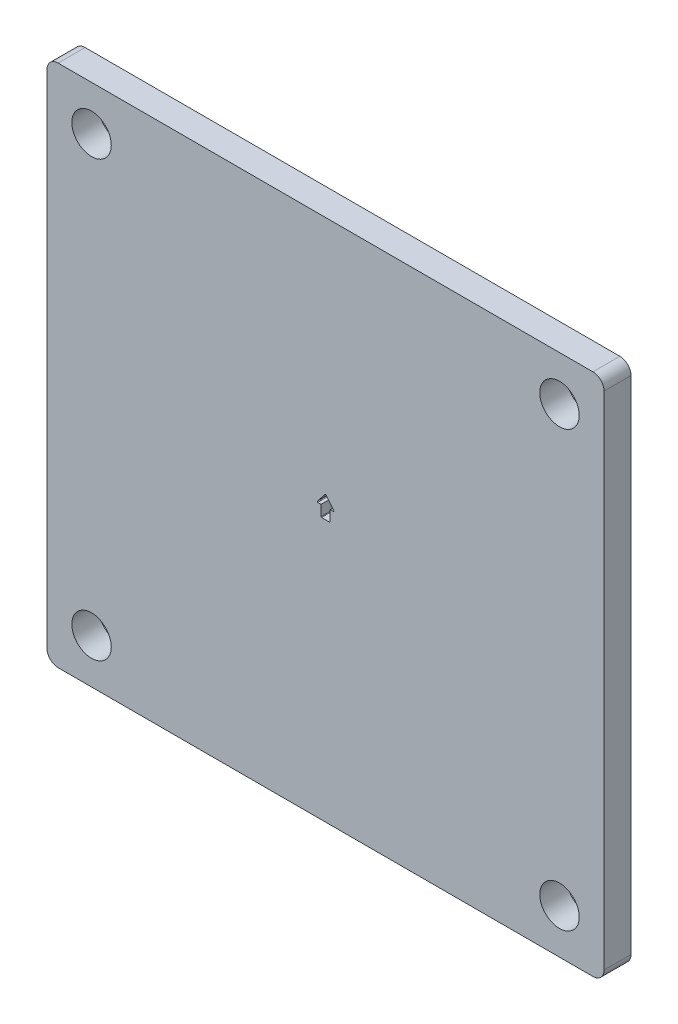
ISO-10303-21;
HEADER;
FILE_DESCRIPTION(('STEP AP214'),'2;1');
FILE_NAME('part.step','',(''),(''),'','','');
FILE_SCHEMA(('AUTOMOTIVE_DESIGN { 1 0 10303 214 1 1 1 1 }'));
ENDSEC;
DATA;
#1=APPLICATION_CONTEXT('core data for automotive mechanical design processes');
#2=APPLICATION_PROTOCOL_DEFINITION('international standard','automotive_design',2000,#1);
#3=PRODUCT_CONTEXT('',#1,'mechanical');
#4=PRODUCT('Part','Part','',(#3));
#5=PRODUCT_RELATED_PRODUCT_CATEGORY('part','',(#4));
#6=PRODUCT_DEFINITION_FORMATION('','',#4);
#7=PRODUCT_DEFINITION_CONTEXT('part definition',#1,'design');
#8=PRODUCT_DEFINITION('design','',#6,#7);
#9=PRODUCT_DEFINITION_SHAPE('','',#8);
#10=(LENGTH_UNIT() NAMED_UNIT(*) SI_UNIT(.MILLI.,.METRE.));
#11=(NAMED_UNIT(*) PLANE_ANGLE_UNIT() SI_UNIT($,.RADIAN.));
#12=(NAMED_UNIT(*) SI_UNIT($,.STERADIAN.) SOLID_ANGLE_UNIT());
#13=UNCERTAINTY_MEASURE_WITH_UNIT(LENGTH_MEASURE(1.E-05),#10,'distance_accuracy_value','');
#14=(GEOMETRIC_REPRESENTATION_CONTEXT(3) GLOBAL_UNCERTAINTY_ASSIGNED_CONTEXT((#13)) GLOBAL_UNIT_ASSIGNED_CONTEXT((#10,
#11,#12)) REPRESENTATION_CONTEXT('',''));
#15=CARTESIAN_POINT('',(0.,0.,0.));
#16=DIRECTION('',(0.,0.,1.));
#17=DIRECTION('',(1.,0.,0.));
#18=AXIS2_PLACEMENT_3D('',#15,#16,#17);
#19=CARTESIAN_POINT('',(0.,0.,3.0734));
#20=DIRECTION('',(1.,0.,0.));
#21=DIRECTION('',(0.,0.,-1.));
#22=AXIS2_PLACEMENT_3D('',#19,#20,#21);
#23=PLANE('',#22);
#24=DIRECTION('',(0.,-1.,0.));
#25=VECTOR('',#24,1.);
#26=CARTESIAN_POINT('',(0.,0.,0.));
#27=LINE('',#26,#25);
#28=CARTESIAN_POINT('',(0.,58.42,0.));
#29=VERTEX_POINT('',#28);
#30=CARTESIAN_POINT('',(0.,1.27,0.));
#31=VERTEX_POINT('',#30);
#32=EDGE_CURVE('E242',#29,#31,#27,.T.);
#33=ORIENTED_EDGE('',*,*,#32,.T.);
#34=DIRECTION('',(0.,0.,-1.));
#35=VECTOR('',#34,1.);
#36=CARTESIAN_POINT('',(0.,1.27,3.0734));
#37=LINE('',#36,#35);
#38=CARTESIAN_POINT('',(0.,1.27,3.0734));
#39=VERTEX_POINT('',#38);
#40=EDGE_CURVE('E282',#31,#39,#37,.F.);
#41=ORIENTED_EDGE('',*,*,#40,.T.);
#42=DIRECTION('',(0.,-1.,0.));
#43=VECTOR('',#42,1.);
#44=CARTESIAN_POINT('',(0.,0.,3.0734));
#45=LINE('',#44,#43);
#46=CARTESIAN_POINT('',(0.,58.42,3.0734));
#47=VERTEX_POINT('',#46);
#48=EDGE_CURVE('E243',#47,#39,#45,.T.);
#49=ORIENTED_EDGE('',*,*,#48,.F.);
#50=DIRECTION('',(0.,0.,-1.));
#51=VECTOR('',#50,1.);
#52=CARTESIAN_POINT('',(0.,58.42,3.0734));
#53=LINE('',#52,#51);
#54=EDGE_CURVE('E279',#47,#29,#53,.T.);
#55=ORIENTED_EDGE('',*,*,#54,.T.);
#56=EDGE_LOOP('',(#33,#41,#49,#55));
#57=FACE_BOUND('',#56,.T.);
#58=ADVANCED_FACE('F32',(#57),#23,.F.);
#59=CARTESIAN_POINT('',(0.,0.,3.0734));
#60=DIRECTION('',(0.,1.,0.));
#61=DIRECTION('',(0.,0.,1.));
#62=AXIS2_PLACEMENT_3D('',#59,#60,#61);
#63=PLANE('',#62);
#64=DIRECTION('',(1.,0.,0.));
#65=VECTOR('',#64,1.);
#66=CARTESIAN_POINT('',(0.,0.,3.0734));
#67=LINE('',#66,#65);
#68=CARTESIAN_POINT('',(1.27,0.,3.0734));
#69=VERTEX_POINT('',#68);
#70=CARTESIAN_POINT('',(62.23,0.,3.0734));
#71=VERTEX_POINT('',#70);
#72=EDGE_CURVE('E246',#69,#71,#67,.T.);
#73=ORIENTED_EDGE('',*,*,#72,.F.);
#74=DIRECTION('',(0.,0.,-1.));
#75=VECTOR('',#74,1.);
#76=CARTESIAN_POINT('',(1.27,0.,3.0734));
#77=LINE('',#76,#75);
#78=CARTESIAN_POINT('',(1.27,0.,0.));
#79=VERTEX_POINT('',#78);
#80=EDGE_CURVE('E268',#69,#79,#77,.T.);
#81=ORIENTED_EDGE('',*,*,#80,.T.);
#82=DIRECTION('',(1.,0.,0.));
#83=VECTOR('',#82,1.);
#84=CARTESIAN_POINT('',(0.,0.,0.));
#85=LINE('',#84,#83);
#86=CARTESIAN_POINT('',(62.23,0.,0.));
#87=VERTEX_POINT('',#86);
#88=EDGE_CURVE('E259',#79,#87,#85,.T.);
#89=ORIENTED_EDGE('',*,*,#88,.T.);
#90=DIRECTION('',(0.,0.,-1.));
#91=VECTOR('',#90,1.);
#92=CARTESIAN_POINT('',(62.23,0.,3.0734));
#93=LINE('',#92,#91);
#94=EDGE_CURVE('E256',#87,#71,#93,.F.);
#95=ORIENTED_EDGE('',*,*,#94,.T.);
#96=EDGE_LOOP('',(#73,#81,#89,#95));
#97=FACE_BOUND('',#96,.T.);
#98=ADVANCED_FACE('F381',(#97),#63,.F.);
#99=CARTESIAN_POINT('',(63.5,0.,3.0734));
#100=DIRECTION('',(-1.,0.,0.));
#101=DIRECTION('',(0.,0.,1.));
#102=AXIS2_PLACEMENT_3D('',#99,#100,#101);
#103=PLANE('',#102);
#104=DIRECTION('',(0.,1.,0.));
#105=VECTOR('',#104,1.);
#106=CARTESIAN_POINT('',(63.5,0.,3.0734));
#107=LINE('',#106,#105);
#108=CARTESIAN_POINT('',(63.5,1.27,3.0734));
#109=VERTEX_POINT('',#108);
#110=CARTESIAN_POINT('',(63.5,58.42,3.0734));
#111=VERTEX_POINT('',#110);
#112=EDGE_CURVE('E250',#109,#111,#107,.T.);
#113=ORIENTED_EDGE('',*,*,#112,.F.);
#114=DIRECTION('',(0.,0.,-1.));
#115=VECTOR('',#114,1.);
#116=CARTESIAN_POINT('',(63.5,1.27,3.0734));
#117=LINE('',#116,#115);
#118=CARTESIAN_POINT('',(63.5,1.27,0.));
#119=VERTEX_POINT('',#118);
#120=EDGE_CURVE('E294',#109,#119,#117,.T.);
#121=ORIENTED_EDGE('',*,*,#120,.T.);
#122=DIRECTION('',(0.,1.,0.));
#123=VECTOR('',#122,1.);
#124=CARTESIAN_POINT('',(63.5,0.,0.));
#125=LINE('',#124,#123);
#126=CARTESIAN_POINT('',(63.5,58.42,0.));
#127=VERTEX_POINT('',#126);
#128=EDGE_CURVE('E262',#119,#127,#125,.T.);
#129=ORIENTED_EDGE('',*,*,#128,.T.);
#130=DIRECTION('',(0.,0.,-1.));
#131=VECTOR('',#130,1.);
#132=CARTESIAN_POINT('',(63.5,58.42,3.0734));
#133=LINE('',#132,#131);
#134=EDGE_CURVE('E292',#127,#111,#133,.F.);
#135=ORIENTED_EDGE('',*,*,#134,.T.);
#136=EDGE_LOOP('',(#113,#121,#129,#135));
#137=FACE_BOUND('',#136,.T.);
#138=ADVANCED_FACE('F387',(#137),#103,.F.);
#139=CARTESIAN_POINT('',(0.,59.69,3.0734));
#140=DIRECTION('',(0.,-1.,0.));
#141=DIRECTION('',(0.,0.,-1.));
#142=AXIS2_PLACEMENT_3D('',#139,#140,#141);
#143=PLANE('',#142);
#144=DIRECTION('',(-1.,0.,0.));
#145=VECTOR('',#144,1.);
#146=CARTESIAN_POINT('',(0.,59.69,3.0734));
#147=LINE('',#146,#145);
#148=CARTESIAN_POINT('',(62.23,59.69,3.0734));
#149=VERTEX_POINT('',#148);
#150=CARTESIAN_POINT('',(1.27,59.69,3.0734));
#151=VERTEX_POINT('',#150);
#152=EDGE_CURVE('E253',#149,#151,#147,.T.);
#153=ORIENTED_EDGE('',*,*,#152,.F.);
#154=DIRECTION('',(0.,0.,-1.));
#155=VECTOR('',#154,1.);
#156=CARTESIAN_POINT('',(62.23,59.69,3.0734));
#157=LINE('',#156,#155);
#158=CARTESIAN_POINT('',(62.23,59.69,0.));
#159=VERTEX_POINT('',#158);
#160=EDGE_CURVE('E299',#149,#159,#157,.T.);
#161=ORIENTED_EDGE('',*,*,#160,.T.);
#162=DIRECTION('',(-1.,0.,0.));
#163=VECTOR('',#162,1.);
#164=CARTESIAN_POINT('',(0.,59.69,0.));
#165=LINE('',#164,#163);
#166=CARTESIAN_POINT('',(1.27,59.69,0.));
#167=VERTEX_POINT('',#166);
#168=EDGE_CURVE('E247',#159,#167,#165,.T.);
#169=ORIENTED_EDGE('',*,*,#168,.T.);
#170=DIRECTION('',(0.,0.,-1.));
#171=VECTOR('',#170,1.);
#172=CARTESIAN_POINT('',(1.27,59.69,3.0734));
#173=LINE('',#172,#171);
#174=EDGE_CURVE('E297',#167,#151,#173,.F.);
#175=ORIENTED_EDGE('',*,*,#174,.T.);
#176=EDGE_LOOP('',(#153,#161,#169,#175));
#177=FACE_BOUND('',#176,.T.);
#178=ADVANCED_FACE('F475',(#177),#143,.F.);
#179=CARTESIAN_POINT('',(0.,0.,3.0734));
#180=DIRECTION('',(0.,0.,-1.));
#181=DIRECTION('',(-1.,0.,0.));
#182=AXIS2_PLACEMENT_3D('',#179,#180,#181);
#183=PLANE('',#182);
#184=DIRECTION('',(1.,0.,0.));
#185=VECTOR('',#184,1.);
#186=CARTESIAN_POINT('',(32.258,31.115,3.0734));
#187=LINE('',#186,#185);
#188=CARTESIAN_POINT('',(32.3215,31.115,3.0734));
#189=VERTEX_POINT('',#188);
#190=CARTESIAN_POINT('',(32.6338803221846,31.115,3.0734));
#191=VERTEX_POINT('',#190);
#192=EDGE_CURVE('E206',#189,#191,#187,.T.);
#193=ORIENTED_EDGE('',*,*,#192,.F.);
#194=CARTESIAN_POINT('',(32.3215,31.0515,3.0734));
#195=DIRECTION('',(0.,0.,-1.));
#196=DIRECTION('',(-1.,0.,0.));
#197=AXIS2_PLACEMENT_3D('',#194,#195,#196);
#198=CIRCLE('',#197,0.0635);
#199=CARTESIAN_POINT('',(32.258,31.0515,3.0734));
#200=VERTEX_POINT('',#199);
#201=EDGE_CURVE('E330',#189,#200,#198,.F.);
#202=ORIENTED_EDGE('',*,*,#201,.T.);
#203=DIRECTION('',(0.,1.,0.));
#204=VECTOR('',#203,1.);
#205=CARTESIAN_POINT('',(32.258,29.845,3.0734));
#206=LINE('',#205,#204);
#207=CARTESIAN_POINT('',(32.258,29.9085,3.0734));
#208=VERTEX_POINT('',#207);
#209=EDGE_CURVE('E203',#208,#200,#206,.T.);
#210=ORIENTED_EDGE('',*,*,#209,.F.);
#211=CARTESIAN_POINT('',(32.1945,29.9085,3.0734));
#212=DIRECTION('',(0.,0.,-1.));
#213=DIRECTION('',(-1.,0.,0.));
#214=AXIS2_PLACEMENT_3D('',#211,#212,#213);
#215=CIRCLE('',#214,0.0635);
#216=CARTESIAN_POINT('',(32.1945,29.845,3.0734));
#217=VERTEX_POINT('',#216);
#218=EDGE_CURVE('E345',#208,#217,#215,.T.);
#219=ORIENTED_EDGE('',*,*,#218,.T.);
#220=DIRECTION('',(1.,0.,0.));
#221=VECTOR('',#220,1.);
#222=CARTESIAN_POINT('',(31.242,29.845,3.0734));
#223=LINE('',#222,#221);
#224=CARTESIAN_POINT('',(31.3055,29.845,3.0734));
#225=VERTEX_POINT('',#224);
#226=EDGE_CURVE('E200',#225,#217,#223,.T.);
#227=ORIENTED_EDGE('',*,*,#226,.F.);
#228=CARTESIAN_POINT('',(31.3055,29.9085,3.0734));
#229=DIRECTION('',(0.,0.,-1.));
#230=DIRECTION('',(-1.,0.,0.));
#231=AXIS2_PLACEMENT_3D('',#228,#229,#230);
#232=CIRCLE('',#231,0.0635);
#233=CARTESIAN_POINT('',(31.242,29.9085,3.0734));
#234=VERTEX_POINT('',#233);
#235=EDGE_CURVE('E40',#225,#234,#232,.T.);
#236=ORIENTED_EDGE('',*,*,#235,.T.);
#237=DIRECTION('',(0.,-1.,0.));
#238=VECTOR('',#237,1.);
#239=CARTESIAN_POINT('',(31.242,29.845,3.0734));
#240=LINE('',#239,#238);
#241=CARTESIAN_POINT('',(31.242,31.115,3.0734));
#242=VERTEX_POINT('',#241);
#243=EDGE_CURVE('E216',#242,#234,#240,.T.);
#244=ORIENTED_EDGE('',*,*,#243,.F.);
#245=DIRECTION('',(1.,0.,0.));
#246=VECTOR('',#245,1.);
#247=CARTESIAN_POINT('',(31.242,31.115,3.0734));
#248=LINE('',#247,#246);
#249=CARTESIAN_POINT('',(30.8661196778154,31.115,3.0734));
#250=VERTEX_POINT('',#249);
#251=EDGE_CURVE('E193',#250,#242,#248,.T.);
#252=ORIENTED_EDGE('',*,*,#251,.F.);
#253=CARTESIAN_POINT('',(30.8661196778154,31.1785,3.0734));
#254=DIRECTION('',(0.,0.,-1.));
#255=DIRECTION('',(-1.,0.,0.));
#256=AXIS2_PLACEMENT_3D('',#253,#254,#255);
#257=CIRCLE('',#256,0.0635);
#258=CARTESIAN_POINT('',(30.8165345084158,31.2181681355197,3.0734));
#259=VERTEX_POINT('',#258);
#260=EDGE_CURVE('E342',#250,#259,#257,.T.);
#261=ORIENTED_EDGE('',*,*,#260,.T.);
#262=DIRECTION('',(-0.624695047554422,-0.780868809443032,0.));
#263=VECTOR('',#262,1.);
#264=CARTESIAN_POINT('',(30.734,31.115,3.0734));
#265=LINE('',#264,#263);
#266=CARTESIAN_POINT('',(31.7004148306004,32.3230185382505,3.0734));
#267=VERTEX_POINT('',#266);
#268=EDGE_CURVE('E212',#267,#259,#265,.T.);
#269=ORIENTED_EDGE('',*,*,#268,.F.);
#270=CARTESIAN_POINT('',(31.75,32.2833504027308,3.0734));
#271=DIRECTION('',(0.,0.,-1.));
#272=DIRECTION('',(-1.,0.,0.));
#273=AXIS2_PLACEMENT_3D('',#270,#271,#272);
#274=CIRCLE('',#273,0.0635);
#275=CARTESIAN_POINT('',(31.7995851693996,32.3230185382505,3.0734));
#276=VERTEX_POINT('',#275);
#277=EDGE_CURVE('E338',#267,#276,#274,.T.);
#278=ORIENTED_EDGE('',*,*,#277,.T.);
#279=DIRECTION('',(-0.624695047554424,0.78086880944303,0.));
#280=VECTOR('',#279,1.);
#281=CARTESIAN_POINT('',(32.766,31.115,3.0734));
#282=LINE('',#281,#280);
#283=CARTESIAN_POINT('',(32.6834654915842,31.2181681355197,3.0734));
#284=VERTEX_POINT('',#283);
#285=EDGE_CURVE('E209',#284,#276,#282,.T.);
#286=ORIENTED_EDGE('',*,*,#285,.F.);
#287=CARTESIAN_POINT('',(32.6338803221846,31.1785,3.0734));
#288=DIRECTION('',(0.,0.,-1.));
#289=DIRECTION('',(-1.,0.,0.));
#290=AXIS2_PLACEMENT_3D('',#287,#288,#289);
#291=CIRCLE('',#290,0.0635);
#292=EDGE_CURVE('E334',#284,#191,#291,.T.);
#293=ORIENTED_EDGE('',*,*,#292,.T.);
#294=EDGE_LOOP('',(#193,#202,#210,#219,#227,#236,#244,#252,#261,#269,#278,#286,#293));
#295=FACE_BOUND('',#294,.T.);
#296=CARTESIAN_POINT('',(5.08,54.61,3.0734));
#297=DIRECTION('',(0.,0.,1.));
#298=DIRECTION('',(1.,0.,0.));
#299=AXIS2_PLACEMENT_3D('',#296,#297,#298);
#300=CIRCLE('',#299,2.24789999999999);
#301=CARTESIAN_POINT('',(7.32789999999999,54.61,3.0734));
#302=VERTEX_POINT('',#301);
#303=EDGE_CURVE('E194',#302,#302,#300,.T.);
#304=ORIENTED_EDGE('',*,*,#303,.F.);
#305=EDGE_LOOP('',(#304));
#306=FACE_BOUND('',#305,.T.);
#307=CARTESIAN_POINT('',(58.42,54.61,3.0734));
#308=DIRECTION('',(0.,0.,1.));
#309=DIRECTION('',(1.,0.,0.));
#310=AXIS2_PLACEMENT_3D('',#307,#308,#309);
#311=CIRCLE('',#310,2.24789999999998);
#312=CARTESIAN_POINT('',(60.6679,54.61,3.0734));
#313=VERTEX_POINT('',#312);
#314=EDGE_CURVE('E224',#313,#313,#311,.T.);
#315=ORIENTED_EDGE('',*,*,#314,.F.);
#316=EDGE_LOOP('',(#315));
#317=FACE_BOUND('',#316,.T.);
#318=CARTESIAN_POINT('',(58.42,5.08,3.0734));
#319=DIRECTION('',(0.,0.,1.));
#320=DIRECTION('',(1.,0.,0.));
#321=AXIS2_PLACEMENT_3D('',#318,#319,#320);
#322=CIRCLE('',#321,2.24789999999998);
#323=CARTESIAN_POINT('',(60.6679,5.08,3.0734));
#324=VERTEX_POINT('',#323);
#325=EDGE_CURVE('E230',#324,#324,#322,.T.);
#326=ORIENTED_EDGE('',*,*,#325,.F.);
#327=EDGE_LOOP('',(#326));
#328=FACE_BOUND('',#327,.T.);
#329=CARTESIAN_POINT('',(5.08,5.08,3.0734));
#330=DIRECTION('',(0.,0.,1.));
#331=DIRECTION('',(1.,0.,0.));
#332=AXIS2_PLACEMENT_3D('',#329,#330,#331);
#333=CIRCLE('',#332,2.24789999999999);
#334=CARTESIAN_POINT('',(7.32789999999999,5.08,3.0734));
#335=VERTEX_POINT('',#334);
#336=EDGE_CURVE('E236',#335,#335,#333,.T.);
#337=ORIENTED_EDGE('',*,*,#336,.F.);
#338=EDGE_LOOP('',(#337));
#339=FACE_BOUND('',#338,.T.);
#340=ORIENTED_EDGE('',*,*,#48,.T.);
#341=CARTESIAN_POINT('',(1.27,1.27,3.0734));
#342=DIRECTION('',(0.,0.,-1.));
#343=DIRECTION('',(-1.,0.,0.));
#344=AXIS2_PLACEMENT_3D('',#341,#342,#343);
#345=CIRCLE('',#344,1.27);
#346=EDGE_CURVE('E290',#39,#69,#345,.F.);
#347=ORIENTED_EDGE('',*,*,#346,.T.);
#348=ORIENTED_EDGE('',*,*,#72,.T.);
#349=CARTESIAN_POINT('',(62.23,1.27,3.0734));
#350=DIRECTION('',(0.,0.,-1.));
#351=DIRECTION('',(-1.,0.,0.));
#352=AXIS2_PLACEMENT_3D('',#349,#350,#351);
#353=CIRCLE('',#352,1.27);
#354=EDGE_CURVE('E288',#71,#109,#353,.F.);
#355=ORIENTED_EDGE('',*,*,#354,.T.);
#356=ORIENTED_EDGE('',*,*,#112,.T.);
#357=CARTESIAN_POINT('',(62.23,58.42,3.0734));
#358=DIRECTION('',(0.,0.,-1.));
#359=DIRECTION('',(-1.,0.,0.));
#360=AXIS2_PLACEMENT_3D('',#357,#358,#359);
#361=CIRCLE('',#360,1.27);
#362=EDGE_CURVE('E286',#111,#149,#361,.F.);
#363=ORIENTED_EDGE('',*,*,#362,.T.);
#364=ORIENTED_EDGE('',*,*,#152,.T.);
#365=CARTESIAN_POINT('',(1.27,58.42,3.0734));
#366=DIRECTION('',(0.,0.,-1.));
#367=DIRECTION('',(-1.,0.,0.));
#368=AXIS2_PLACEMENT_3D('',#365,#366,#367);
#369=CIRCLE('',#368,1.27);
#370=EDGE_CURVE('E284',#151,#47,#369,.F.);
#371=ORIENTED_EDGE('',*,*,#370,.T.);
#372=EDGE_LOOP('',(#340,#347,#348,#355,#356,#363,#364,#371));
#373=FACE_BOUND('',#372,.T.);
#374=ADVANCED_FACE('F365',(#295,#306,#317,#328,#339,#373),#183,.F.);
#375=CARTESIAN_POINT('',(0.,0.,0.));
#376=DIRECTION('',(0.,0.,-1.));
#377=DIRECTION('',(-1.,0.,0.));
#378=AXIS2_PLACEMENT_3D('',#375,#376,#377);
#379=PLANE('',#378);
#380=DIRECTION('',(0.,1.,0.));
#381=VECTOR('',#380,1.);
#382=CARTESIAN_POINT('',(32.258,29.845,0.));
#383=LINE('',#382,#381);
#384=CARTESIAN_POINT('',(32.258,29.9085,0.));
#385=VERTEX_POINT('',#384);
#386=CARTESIAN_POINT('',(32.258,31.0515,0.));
#387=VERTEX_POINT('',#386);
#388=EDGE_CURVE('E351',#385,#387,#383,.T.);
#389=ORIENTED_EDGE('',*,*,#388,.T.);
#390=CARTESIAN_POINT('',(32.3215,31.0515,0.));
#391=DIRECTION('',(0.,0.,-1.));
#392=DIRECTION('',(-1.,0.,0.));
#393=AXIS2_PLACEMENT_3D('',#390,#391,#392);
#394=CIRCLE('',#393,0.0635);
#395=CARTESIAN_POINT('',(32.3215,31.115,0.));
#396=VERTEX_POINT('',#395);
#397=EDGE_CURVE('E332',#387,#396,#394,.T.);
#398=ORIENTED_EDGE('',*,*,#397,.T.);
#399=DIRECTION('',(1.,0.,0.));
#400=VECTOR('',#399,1.);
#401=CARTESIAN_POINT('',(32.258,31.115,0.));
#402=LINE('',#401,#400);
#403=CARTESIAN_POINT('',(32.6338803221846,31.115,0.));
#404=VERTEX_POINT('',#403);
#405=EDGE_CURVE('E361',#396,#404,#402,.T.);
#406=ORIENTED_EDGE('',*,*,#405,.T.);
#407=CARTESIAN_POINT('',(32.6338803221846,31.1785,0.));
#408=DIRECTION('',(0.,0.,-1.));
#409=DIRECTION('',(-1.,0.,0.));
#410=AXIS2_PLACEMENT_3D('',#407,#408,#409);
#411=CIRCLE('',#410,0.0635);
#412=CARTESIAN_POINT('',(32.6834654915842,31.2181681355197,0.));
#413=VERTEX_POINT('',#412);
#414=EDGE_CURVE('E336',#404,#413,#411,.F.);
#415=ORIENTED_EDGE('',*,*,#414,.T.);
#416=DIRECTION('',(-0.624695047554424,0.78086880944303,0.));
#417=VECTOR('',#416,1.);
#418=CARTESIAN_POINT('',(32.766,31.115,0.));
#419=LINE('',#418,#417);
#420=CARTESIAN_POINT('',(31.7995851693996,32.3230185382505,0.));
#421=VERTEX_POINT('',#420);
#422=EDGE_CURVE('E435',#413,#421,#419,.T.);
#423=ORIENTED_EDGE('',*,*,#422,.T.);
#424=CARTESIAN_POINT('',(31.75,32.2833504027308,0.));
#425=DIRECTION('',(0.,0.,-1.));
#426=DIRECTION('',(-1.,0.,0.));
#427=AXIS2_PLACEMENT_3D('',#424,#425,#426);
#428=CIRCLE('',#427,0.0635);
#429=CARTESIAN_POINT('',(31.7004148306004,32.3230185382505,0.));
#430=VERTEX_POINT('',#429);
#431=EDGE_CURVE('E340',#421,#430,#428,.F.);
#432=ORIENTED_EDGE('',*,*,#431,.T.);
#433=DIRECTION('',(-0.624695047554422,-0.780868809443032,0.));
#434=VECTOR('',#433,1.);
#435=CARTESIAN_POINT('',(30.734,31.115,0.));
#436=LINE('',#435,#434);
#437=CARTESIAN_POINT('',(30.8165345084158,31.2181681355197,0.));
#438=VERTEX_POINT('',#437);
#439=EDGE_CURVE('E187',#430,#438,#436,.T.);
#440=ORIENTED_EDGE('',*,*,#439,.T.);
#441=CARTESIAN_POINT('',(30.8661196778154,31.1785,0.));
#442=DIRECTION('',(0.,0.,-1.));
#443=DIRECTION('',(-1.,0.,0.));
#444=AXIS2_PLACEMENT_3D('',#441,#442,#443);
#445=CIRCLE('',#444,0.0635);
#446=CARTESIAN_POINT('',(30.8661196778154,31.115,0.));
#447=VERTEX_POINT('',#446);
#448=EDGE_CURVE('E183',#438,#447,#445,.F.);
#449=ORIENTED_EDGE('',*,*,#448,.T.);
#450=DIRECTION('',(1.,0.,0.));
#451=VECTOR('',#450,1.);
#452=CARTESIAN_POINT('',(31.242,31.115,0.));
#453=LINE('',#452,#451);
#454=CARTESIAN_POINT('',(31.242,31.115,0.));
#455=VERTEX_POINT('',#454);
#456=EDGE_CURVE('E174',#447,#455,#453,.T.);
#457=ORIENTED_EDGE('',*,*,#456,.T.);
#458=DIRECTION('',(0.,-1.,0.));
#459=VECTOR('',#458,1.);
#460=CARTESIAN_POINT('',(31.242,29.845,0.));
#461=LINE('',#460,#459);
#462=CARTESIAN_POINT('',(31.242,29.9085,0.));
#463=VERTEX_POINT('',#462);
#464=EDGE_CURVE('E179',#455,#463,#461,.T.);
#465=ORIENTED_EDGE('',*,*,#464,.T.);
#466=CARTESIAN_POINT('',(31.3055,29.9085,0.));
#467=DIRECTION('',(0.,0.,-1.));
#468=DIRECTION('',(-1.,0.,0.));
#469=AXIS2_PLACEMENT_3D('',#466,#467,#468);
#470=CIRCLE('',#469,0.0635);
#471=CARTESIAN_POINT('',(31.3055,29.845,0.));
#472=VERTEX_POINT('',#471);
#473=EDGE_CURVE('E11',#463,#472,#470,.F.);
#474=ORIENTED_EDGE('',*,*,#473,.T.);
#475=DIRECTION('',(1.,0.,0.));
#476=VECTOR('',#475,1.);
#477=CARTESIAN_POINT('',(31.242,29.845,0.));
#478=LINE('',#477,#476);
#479=CARTESIAN_POINT('',(32.1945,29.845,0.));
#480=VERTEX_POINT('',#479);
#481=EDGE_CURVE('E217',#472,#480,#478,.T.);
#482=ORIENTED_EDGE('',*,*,#481,.T.);
#483=CARTESIAN_POINT('',(32.1945,29.9085,0.));
#484=DIRECTION('',(0.,0.,-1.));
#485=DIRECTION('',(-1.,0.,0.));
#486=AXIS2_PLACEMENT_3D('',#483,#484,#485);
#487=CIRCLE('',#486,0.0635);
#488=EDGE_CURVE('E347',#480,#385,#487,.F.);
#489=ORIENTED_EDGE('',*,*,#488,.T.);
#490=EDGE_LOOP('',(#389,#398,#406,#415,#423,#432,#440,#449,#457,#465,#474,#482,#489));
#491=FACE_BOUND('',#490,.T.);
#492=CARTESIAN_POINT('',(5.08,54.61,0.));
#493=DIRECTION('',(0.,0.,1.));
#494=DIRECTION('',(1.,0.,0.));
#495=AXIS2_PLACEMENT_3D('',#492,#493,#494);
#496=CIRCLE('',#495,2.2479);
#497=CARTESIAN_POINT('',(7.3279,54.61,0.));
#498=VERTEX_POINT('',#497);
#499=EDGE_CURVE('E221',#498,#498,#496,.T.);
#500=ORIENTED_EDGE('',*,*,#499,.T.);
#501=EDGE_LOOP('',(#500));
#502=FACE_BOUND('',#501,.T.);
#503=CARTESIAN_POINT('',(58.42,54.61,0.));
#504=DIRECTION('',(0.,0.,1.));
#505=DIRECTION('',(1.,0.,0.));
#506=AXIS2_PLACEMENT_3D('',#503,#504,#505);
#507=CIRCLE('',#506,2.2479);
#508=CARTESIAN_POINT('',(60.6679,54.61,0.));
#509=VERTEX_POINT('',#508);
#510=EDGE_CURVE('E227',#509,#509,#507,.T.);
#511=ORIENTED_EDGE('',*,*,#510,.T.);
#512=EDGE_LOOP('',(#511));
#513=FACE_BOUND('',#512,.T.);
#514=CARTESIAN_POINT('',(58.42,5.08,0.));
#515=DIRECTION('',(0.,0.,1.));
#516=DIRECTION('',(1.,0.,0.));
#517=AXIS2_PLACEMENT_3D('',#514,#515,#516);
#518=CIRCLE('',#517,2.2479);
#519=CARTESIAN_POINT('',(60.6679,5.08,0.));
#520=VERTEX_POINT('',#519);
#521=EDGE_CURVE('E233',#520,#520,#518,.T.);
#522=ORIENTED_EDGE('',*,*,#521,.T.);
#523=EDGE_LOOP('',(#522));
#524=FACE_BOUND('',#523,.T.);
#525=CARTESIAN_POINT('',(5.08,5.08,0.));
#526=DIRECTION('',(0.,0.,1.));
#527=DIRECTION('',(1.,0.,0.));
#528=AXIS2_PLACEMENT_3D('',#525,#526,#527);
#529=CIRCLE('',#528,2.2479);
#530=CARTESIAN_POINT('',(7.3279,5.08,0.));
#531=VERTEX_POINT('',#530);
#532=EDGE_CURVE('E239',#531,#531,#529,.T.);
#533=ORIENTED_EDGE('',*,*,#532,.T.);
#534=EDGE_LOOP('',(#533));
#535=FACE_BOUND('',#534,.T.);
#536=ORIENTED_EDGE('',*,*,#88,.F.);
#537=CARTESIAN_POINT('',(1.27,1.27,0.));
#538=DIRECTION('',(0.,0.,-1.));
#539=DIRECTION('',(-1.,0.,0.));
#540=AXIS2_PLACEMENT_3D('',#537,#538,#539);
#541=CIRCLE('',#540,1.27);
#542=EDGE_CURVE('E277',#79,#31,#541,.T.);
#543=ORIENTED_EDGE('',*,*,#542,.T.);
#544=ORIENTED_EDGE('',*,*,#32,.F.);
#545=CARTESIAN_POINT('',(1.27,58.42,0.));
#546=DIRECTION('',(0.,0.,-1.));
#547=DIRECTION('',(-1.,0.,0.));
#548=AXIS2_PLACEMENT_3D('',#545,#546,#547);
#549=CIRCLE('',#548,1.27);
#550=EDGE_CURVE('E271',#29,#167,#549,.T.);
#551=ORIENTED_EDGE('',*,*,#550,.T.);
#552=ORIENTED_EDGE('',*,*,#168,.F.);
#553=CARTESIAN_POINT('',(62.23,58.42,0.));
#554=DIRECTION('',(0.,0.,-1.));
#555=DIRECTION('',(-1.,0.,0.));
#556=AXIS2_PLACEMENT_3D('',#553,#554,#555);
#557=CIRCLE('',#556,1.27);
#558=EDGE_CURVE('E273',#159,#127,#557,.T.);
#559=ORIENTED_EDGE('',*,*,#558,.T.);
#560=ORIENTED_EDGE('',*,*,#128,.F.);
#561=CARTESIAN_POINT('',(62.23,1.27,0.));
#562=DIRECTION('',(0.,0.,-1.));
#563=DIRECTION('',(-1.,0.,0.));
#564=AXIS2_PLACEMENT_3D('',#561,#562,#563);
#565=CIRCLE('',#564,1.27);
#566=EDGE_CURVE('E275',#119,#87,#565,.T.);
#567=ORIENTED_EDGE('',*,*,#566,.T.);
#568=EDGE_LOOP('',(#536,#543,#544,#551,#552,#559,#560,#567));
#569=FACE_BOUND('',#568,.T.);
#570=ADVANCED_FACE('F177',(#491,#502,#513,#524,#535,#569),#379,.T.);
#571=CARTESIAN_POINT('',(1.27,1.27,3.0734));
#572=DIRECTION('',(0.,0.,-1.));
#573=DIRECTION('',(-1.,0.,0.));
#574=AXIS2_PLACEMENT_3D('',#571,#572,#573);
#575=CYLINDRICAL_SURFACE('',#574,1.27);
#576=ORIENTED_EDGE('',*,*,#346,.F.);
#577=ORIENTED_EDGE('',*,*,#40,.F.);
#578=ORIENTED_EDGE('',*,*,#542,.F.);
#579=ORIENTED_EDGE('',*,*,#80,.F.);
#580=EDGE_LOOP('',(#576,#577,#578,#579));
#581=FACE_BOUND('',#580,.T.);
#582=ADVANCED_FACE('F392',(#581),#575,.T.);
#583=CARTESIAN_POINT('',(62.23,1.27,3.0734));
#584=DIRECTION('',(0.,0.,-1.));
#585=DIRECTION('',(-1.,0.,0.));
#586=AXIS2_PLACEMENT_3D('',#583,#584,#585);
#587=CYLINDRICAL_SURFACE('',#586,1.27);
#588=ORIENTED_EDGE('',*,*,#354,.F.);
#589=ORIENTED_EDGE('',*,*,#94,.F.);
#590=ORIENTED_EDGE('',*,*,#566,.F.);
#591=ORIENTED_EDGE('',*,*,#120,.F.);
#592=EDGE_LOOP('',(#588,#589,#590,#591));
#593=FACE_BOUND('',#592,.T.);
#594=ADVANCED_FACE('F395',(#593),#587,.T.);
#595=CARTESIAN_POINT('',(62.23,58.42,3.0734));
#596=DIRECTION('',(0.,0.,-1.));
#597=DIRECTION('',(-1.,0.,0.));
#598=AXIS2_PLACEMENT_3D('',#595,#596,#597);
#599=CYLINDRICAL_SURFACE('',#598,1.27);
#600=ORIENTED_EDGE('',*,*,#362,.F.);
#601=ORIENTED_EDGE('',*,*,#134,.F.);
#602=ORIENTED_EDGE('',*,*,#558,.F.);
#603=ORIENTED_EDGE('',*,*,#160,.F.);
#604=EDGE_LOOP('',(#600,#601,#602,#603));
#605=FACE_BOUND('',#604,.T.);
#606=ADVANCED_FACE('F399',(#605),#599,.T.);
#607=CARTESIAN_POINT('',(1.27,58.42,3.0734));
#608=DIRECTION('',(0.,0.,-1.));
#609=DIRECTION('',(-1.,0.,0.));
#610=AXIS2_PLACEMENT_3D('',#607,#608,#609);
#611=CYLINDRICAL_SURFACE('',#610,1.27);
#612=ORIENTED_EDGE('',*,*,#370,.F.);
#613=ORIENTED_EDGE('',*,*,#174,.F.);
#614=ORIENTED_EDGE('',*,*,#550,.F.);
#615=ORIENTED_EDGE('',*,*,#54,.F.);
#616=EDGE_LOOP('',(#612,#613,#614,#615));
#617=FACE_BOUND('',#616,.T.);
#618=ADVANCED_FACE('F403',(#617),#611,.T.);
#619=CARTESIAN_POINT('',(5.08,5.08,3.0734));
#620=DIRECTION('',(0.,0.,1.));
#621=DIRECTION('',(1.,0.,0.));
#622=AXIS2_PLACEMENT_3D('',#619,#620,#621);
#623=CYLINDRICAL_SURFACE('',#622,2.24789999999999);
#624=ORIENTED_EDGE('',*,*,#532,.F.);
#625=EDGE_LOOP('',(#624));
#626=FACE_BOUND('',#625,.T.);
#627=ORIENTED_EDGE('',*,*,#336,.T.);
#628=EDGE_LOOP('',(#627));
#629=FACE_BOUND('',#628,.T.);
#630=ADVANCED_FACE('F407',(#626,#629),#623,.F.);
#631=CARTESIAN_POINT('',(58.42,5.08,3.0734));
#632=DIRECTION('',(0.,0.,1.));
#633=DIRECTION('',(1.,0.,0.));
#634=AXIS2_PLACEMENT_3D('',#631,#632,#633);
#635=CYLINDRICAL_SURFACE('',#634,2.24789999999999);
#636=ORIENTED_EDGE('',*,*,#521,.F.);
#637=EDGE_LOOP('',(#636));
#638=FACE_BOUND('',#637,.T.);
#639=ORIENTED_EDGE('',*,*,#325,.T.);
#640=EDGE_LOOP('',(#639));
#641=FACE_BOUND('',#640,.T.);
#642=ADVANCED_FACE('F465',(#638,#641),#635,.F.);
#643=CARTESIAN_POINT('',(58.42,54.61,3.0734));
#644=DIRECTION('',(0.,0.,1.));
#645=DIRECTION('',(1.,0.,0.));
#646=AXIS2_PLACEMENT_3D('',#643,#644,#645);
#647=CYLINDRICAL_SURFACE('',#646,2.24789999999999);
#648=ORIENTED_EDGE('',*,*,#510,.F.);
#649=EDGE_LOOP('',(#648));
#650=FACE_BOUND('',#649,.T.);
#651=ORIENTED_EDGE('',*,*,#314,.T.);
#652=EDGE_LOOP('',(#651));
#653=FACE_BOUND('',#652,.T.);
#654=ADVANCED_FACE('F461',(#650,#653),#647,.F.);
#655=CARTESIAN_POINT('',(5.08,54.61,3.0734));
#656=DIRECTION('',(0.,0.,1.));
#657=DIRECTION('',(1.,0.,0.));
#658=AXIS2_PLACEMENT_3D('',#655,#656,#657);
#659=CYLINDRICAL_SURFACE('',#658,2.24789999999999);
#660=ORIENTED_EDGE('',*,*,#499,.F.);
#661=EDGE_LOOP('',(#660));
#662=FACE_BOUND('',#661,.T.);
#663=ORIENTED_EDGE('',*,*,#303,.T.);
#664=EDGE_LOOP('',(#663));
#665=FACE_BOUND('',#664,.T.);
#666=ADVANCED_FACE('F458',(#662,#665),#659,.F.);
#667=CARTESIAN_POINT('',(31.242,29.845,0.));
#668=DIRECTION('',(0.,-1.,0.));
#669=DIRECTION('',(0.,0.,-1.));
#670=AXIS2_PLACEMENT_3D('',#667,#668,#669);
#671=PLANE('',#670);
#672=ORIENTED_EDGE('',*,*,#226,.T.);
#673=DIRECTION('',(0.,0.,1.));
#674=VECTOR('',#673,1.);
#675=CARTESIAN_POINT('',(32.1945,29.845,0.));
#676=LINE('',#675,#674);
#677=EDGE_CURVE('E327',#217,#480,#676,.F.);
#678=ORIENTED_EDGE('',*,*,#677,.T.);
#679=ORIENTED_EDGE('',*,*,#481,.F.);
#680=DIRECTION('',(0.,0.,1.));
#681=VECTOR('',#680,1.);
#682=CARTESIAN_POINT('',(31.3055,29.845,3.0734));
#683=LINE('',#682,#681);
#684=EDGE_CURVE('E324',#472,#225,#683,.T.);
#685=ORIENTED_EDGE('',*,*,#684,.T.);
#686=EDGE_LOOP('',(#672,#678,#679,#685));
#687=FACE_BOUND('',#686,.T.);
#688=ADVANCED_FACE('F368',(#687),#671,.F.);
#689=CARTESIAN_POINT('',(31.242,29.845,0.));
#690=DIRECTION('',(-1.,0.,0.));
#691=DIRECTION('',(0.,-1.,0.));
#692=AXIS2_PLACEMENT_3D('',#689,#690,#691);
#693=PLANE('',#692);
#694=ORIENTED_EDGE('',*,*,#243,.T.);
#695=DIRECTION('',(0.,0.,1.));
#696=VECTOR('',#695,1.);
#697=CARTESIAN_POINT('',(31.242,29.9085,0.));
#698=LINE('',#697,#696);
#699=EDGE_CURVE('E47',#234,#463,#698,.F.);
#700=ORIENTED_EDGE('',*,*,#699,.T.);
#701=ORIENTED_EDGE('',*,*,#464,.F.);
#702=DIRECTION('',(0.,0.,1.));
#703=VECTOR('',#702,1.);
#704=CARTESIAN_POINT('',(31.242,31.115,0.));
#705=LINE('',#704,#703);
#706=EDGE_CURVE('E190',#455,#242,#705,.T.);
#707=ORIENTED_EDGE('',*,*,#706,.T.);
#708=EDGE_LOOP('',(#694,#700,#701,#707));
#709=FACE_BOUND('',#708,.T.);
#710=ADVANCED_FACE('F196',(#709),#693,.F.);
#711=CARTESIAN_POINT('',(31.242,31.115,0.));
#712=DIRECTION('',(0.,-1.,0.));
#713=DIRECTION('',(0.,0.,-1.));
#714=AXIS2_PLACEMENT_3D('',#711,#712,#713);
#715=PLANE('',#714);
#716=ORIENTED_EDGE('',*,*,#456,.F.);
#717=DIRECTION('',(0.,0.,1.));
#718=VECTOR('',#717,1.);
#719=CARTESIAN_POINT('',(30.8661196778154,31.115,3.0734));
#720=LINE('',#719,#718);
#721=EDGE_CURVE('E317',#447,#250,#720,.T.);
#722=ORIENTED_EDGE('',*,*,#721,.T.);
#723=ORIENTED_EDGE('',*,*,#251,.T.);
#724=ORIENTED_EDGE('',*,*,#706,.F.);
#725=EDGE_LOOP('',(#716,#722,#723,#724));
#726=FACE_BOUND('',#725,.T.);
#727=ADVANCED_FACE('F191',(#726),#715,.F.);
#728=CARTESIAN_POINT('',(30.734,31.115,0.));
#729=DIRECTION('',(-0.780868809443032,0.624695047554422,0.));
#730=DIRECTION('',(-0.624695047554422,-0.780868809443032,0.));
#731=AXIS2_PLACEMENT_3D('',#728,#729,#730);
#732=PLANE('',#731);
#733=ORIENTED_EDGE('',*,*,#439,.F.);
#734=DIRECTION('',(0.,0.,1.));
#735=VECTOR('',#734,1.);
#736=CARTESIAN_POINT('',(31.7004148306004,32.3230185382505,3.0734));
#737=LINE('',#736,#735);
#738=EDGE_CURVE('E314',#430,#267,#737,.T.);
#739=ORIENTED_EDGE('',*,*,#738,.T.);
#740=ORIENTED_EDGE('',*,*,#268,.T.);
#741=DIRECTION('',(0.,0.,1.));
#742=VECTOR('',#741,1.);
#743=CARTESIAN_POINT('',(30.8165345084158,31.2181681355197,0.));
#744=LINE('',#743,#742);
#745=EDGE_CURVE('E312',#259,#438,#744,.F.);
#746=ORIENTED_EDGE('',*,*,#745,.T.);
#747=EDGE_LOOP('',(#733,#739,#740,#746));
#748=FACE_BOUND('',#747,.T.);
#749=ADVANCED_FACE('F425',(#748),#732,.F.);
#750=CARTESIAN_POINT('',(32.766,31.115,0.));
#751=DIRECTION('',(0.78086880944303,0.624695047554424,0.));
#752=DIRECTION('',(-0.624695047554424,0.78086880944303,0.));
#753=AXIS2_PLACEMENT_3D('',#750,#751,#752);
#754=PLANE('',#753);
#755=ORIENTED_EDGE('',*,*,#422,.F.);
#756=DIRECTION('',(0.,0.,1.));
#757=VECTOR('',#756,1.);
#758=CARTESIAN_POINT('',(32.6834654915842,31.2181681355197,3.0734));
#759=LINE('',#758,#757);
#760=EDGE_CURVE('E304',#413,#284,#759,.T.);
#761=ORIENTED_EDGE('',*,*,#760,.T.);
#762=ORIENTED_EDGE('',*,*,#285,.T.);
#763=DIRECTION('',(0.,0.,1.));
#764=VECTOR('',#763,1.);
#765=CARTESIAN_POINT('',(31.7995851693996,32.3230185382505,0.));
#766=LINE('',#765,#764);
#767=EDGE_CURVE('E302',#276,#421,#766,.F.);
#768=ORIENTED_EDGE('',*,*,#767,.T.);
#769=EDGE_LOOP('',(#755,#761,#762,#768));
#770=FACE_BOUND('',#769,.T.);
#771=ADVANCED_FACE('F432',(#770),#754,.F.);
#772=CARTESIAN_POINT('',(32.258,31.115,0.));
#773=DIRECTION('',(0.,-1.,0.));
#774=DIRECTION('',(0.,0.,-1.));
#775=AXIS2_PLACEMENT_3D('',#772,#773,#774);
#776=PLANE('',#775);
#777=ORIENTED_EDGE('',*,*,#192,.T.);
#778=DIRECTION('',(0.,0.,1.));
#779=VECTOR('',#778,1.);
#780=CARTESIAN_POINT('',(32.6338803221846,31.115,0.));
#781=LINE('',#780,#779);
#782=EDGE_CURVE('E310',#191,#404,#781,.F.);
#783=ORIENTED_EDGE('',*,*,#782,.T.);
#784=ORIENTED_EDGE('',*,*,#405,.F.);
#785=DIRECTION('',(0.,0.,1.));
#786=VECTOR('',#785,1.);
#787=CARTESIAN_POINT('',(32.3215,31.115,0.));
#788=LINE('',#787,#786);
#789=EDGE_CURVE('E307',#396,#189,#788,.T.);
#790=ORIENTED_EDGE('',*,*,#789,.T.);
#791=EDGE_LOOP('',(#777,#783,#784,#790));
#792=FACE_BOUND('',#791,.T.);
#793=ADVANCED_FACE('F439',(#792),#776,.F.);
#794=CARTESIAN_POINT('',(32.258,29.845,0.));
#795=DIRECTION('',(1.,0.,0.));
#796=DIRECTION('',(0.,0.,-1.));
#797=AXIS2_PLACEMENT_3D('',#794,#795,#796);
#798=PLANE('',#797);
#799=ORIENTED_EDGE('',*,*,#388,.F.);
#800=DIRECTION('',(0.,0.,1.));
#801=VECTOR('',#800,1.);
#802=CARTESIAN_POINT('',(32.258,29.9085,3.0734));
#803=LINE('',#802,#801);
#804=EDGE_CURVE('E321',#385,#208,#803,.T.);
#805=ORIENTED_EDGE('',*,*,#804,.T.);
#806=ORIENTED_EDGE('',*,*,#209,.T.);
#807=DIRECTION('',(0.,0.,1.));
#808=VECTOR('',#807,1.);
#809=CARTESIAN_POINT('',(32.258,31.0515,0.));
#810=LINE('',#809,#808);
#811=EDGE_CURVE('E319',#200,#387,#810,.F.);
#812=ORIENTED_EDGE('',*,*,#811,.T.);
#813=EDGE_LOOP('',(#799,#805,#806,#812));
#814=FACE_BOUND('',#813,.T.);
#815=ADVANCED_FACE('F358',(#814),#798,.F.);
#816=CARTESIAN_POINT('',(32.6338803221846,31.1785,0.));
#817=DIRECTION('',(0.,0.,-1.));
#818=DIRECTION('',(-1.,0.,0.));
#819=AXIS2_PLACEMENT_3D('',#816,#817,#818);
#820=CYLINDRICAL_SURFACE('',#819,0.0635);
#821=ORIENTED_EDGE('',*,*,#414,.F.);
#822=ORIENTED_EDGE('',*,*,#782,.F.);
#823=ORIENTED_EDGE('',*,*,#292,.F.);
#824=ORIENTED_EDGE('',*,*,#760,.F.);
#825=EDGE_LOOP('',(#821,#822,#823,#824));
#826=FACE_BOUND('',#825,.T.);
#827=ADVANCED_FACE('F409',(#826),#820,.F.);
#828=CARTESIAN_POINT('',(31.75,32.2833504027308,0.));
#829=DIRECTION('',(0.,0.,-1.));
#830=DIRECTION('',(-1.,0.,0.));
#831=AXIS2_PLACEMENT_3D('',#828,#829,#830);
#832=CYLINDRICAL_SURFACE('',#831,0.0635);
#833=ORIENTED_EDGE('',*,*,#431,.F.);
#834=ORIENTED_EDGE('',*,*,#767,.F.);
#835=ORIENTED_EDGE('',*,*,#277,.F.);
#836=ORIENTED_EDGE('',*,*,#738,.F.);
#837=EDGE_LOOP('',(#833,#834,#835,#836));
#838=FACE_BOUND('',#837,.T.);
#839=ADVANCED_FACE('F412',(#838),#832,.F.);
#840=CARTESIAN_POINT('',(30.8661196778154,31.1785,0.));
#841=DIRECTION('',(0.,0.,-1.));
#842=DIRECTION('',(-1.,0.,0.));
#843=AXIS2_PLACEMENT_3D('',#840,#841,#842);
#844=CYLINDRICAL_SURFACE('',#843,0.0635);
#845=ORIENTED_EDGE('',*,*,#448,.F.);
#846=ORIENTED_EDGE('',*,*,#745,.F.);
#847=ORIENTED_EDGE('',*,*,#260,.F.);
#848=ORIENTED_EDGE('',*,*,#721,.F.);
#849=EDGE_LOOP('',(#845,#846,#847,#848));
#850=FACE_BOUND('',#849,.T.);
#851=ADVANCED_FACE('F378',(#850),#844,.F.);
#852=CARTESIAN_POINT('',(32.1945,29.9085,0.));
#853=DIRECTION('',(0.,0.,-1.));
#854=DIRECTION('',(-1.,0.,0.));
#855=AXIS2_PLACEMENT_3D('',#852,#853,#854);
#856=CYLINDRICAL_SURFACE('',#855,0.0635);
#857=ORIENTED_EDGE('',*,*,#488,.F.);
#858=ORIENTED_EDGE('',*,*,#677,.F.);
#859=ORIENTED_EDGE('',*,*,#218,.F.);
#860=ORIENTED_EDGE('',*,*,#804,.F.);
#861=EDGE_LOOP('',(#857,#858,#859,#860));
#862=FACE_BOUND('',#861,.T.);
#863=ADVANCED_FACE('F363',(#862),#856,.F.);
#864=CARTESIAN_POINT('',(31.3055,29.9085,0.));
#865=DIRECTION('',(0.,0.,-1.));
#866=DIRECTION('',(-1.,0.,0.));
#867=AXIS2_PLACEMENT_3D('',#864,#865,#866);
#868=CYLINDRICAL_SURFACE('',#867,0.0635);
#869=ORIENTED_EDGE('',*,*,#473,.F.);
#870=ORIENTED_EDGE('',*,*,#699,.F.);
#871=ORIENTED_EDGE('',*,*,#235,.F.);
#872=ORIENTED_EDGE('',*,*,#684,.F.);
#873=EDGE_LOOP('',(#869,#870,#871,#872));
#874=FACE_BOUND('',#873,.T.);
#875=ADVANCED_FACE('F371',(#874),#868,.F.);
#876=CARTESIAN_POINT('',(32.3215,31.0515,0.));
#877=DIRECTION('',(0.,0.,1.));
#878=DIRECTION('',(1.,0.,0.));
#879=AXIS2_PLACEMENT_3D('',#876,#877,#878);
#880=CYLINDRICAL_SURFACE('',#879,0.0635);
#881=ORIENTED_EDGE('',*,*,#397,.F.);
#882=ORIENTED_EDGE('',*,*,#811,.F.);
#883=ORIENTED_EDGE('',*,*,#201,.F.);
#884=ORIENTED_EDGE('',*,*,#789,.F.);
#885=EDGE_LOOP('',(#881,#882,#883,#884));
#886=FACE_BOUND('',#885,.T.);
#887=ADVANCED_FACE('F34',(#886),#880,.T.);
#888=CLOSED_SHELL('',(#58,#98,#138,#178,#374,#570,#582,#594,#606,#618,#630,#642,#654,#666,#688,
#710,#727,#749,#771,#793,#815,#827,#839,#851,#863,#875,#887));
#889=MANIFOLD_SOLID_BREP('B2',#888);
#890=ADVANCED_BREP_SHAPE_REPRESENTATION('',(#18,#889),#14);
#891=SHAPE_DEFINITION_REPRESENTATION(#9,#890);
ENDSEC;
END-ISO-10303-21;
